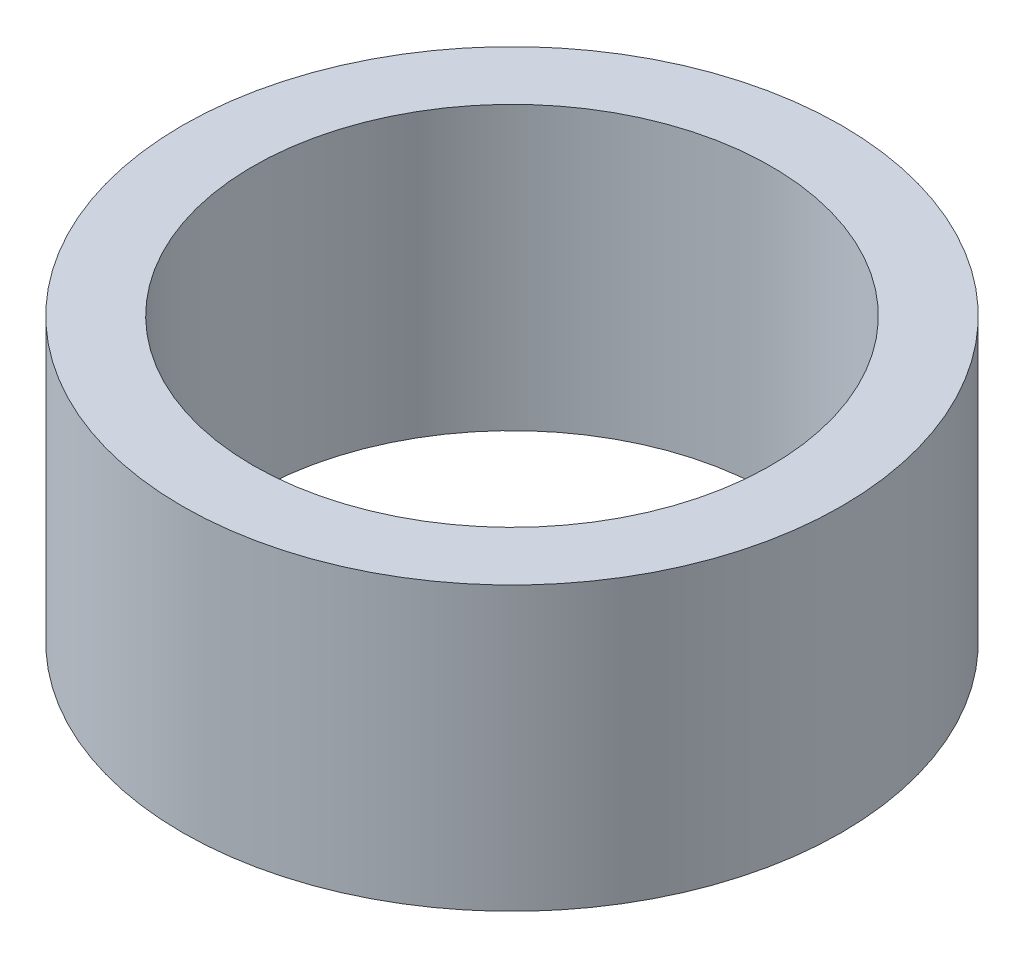
ISO-10303-21;
HEADER;
FILE_DESCRIPTION(('STEP AP214'),'2;1');
FILE_NAME('part.step','',(''),(''),'','','');
FILE_SCHEMA(('AUTOMOTIVE_DESIGN { 1 0 10303 214 1 1 1 1 }'));
ENDSEC;
DATA;
#1=APPLICATION_CONTEXT('core data for automotive mechanical design processes');
#2=APPLICATION_PROTOCOL_DEFINITION('international standard','automotive_design',2000,#1);
#3=PRODUCT_CONTEXT('',#1,'mechanical');
#4=PRODUCT('Part','Part','',(#3));
#5=PRODUCT_RELATED_PRODUCT_CATEGORY('part','',(#4));
#6=PRODUCT_DEFINITION_FORMATION('','',#4);
#7=PRODUCT_DEFINITION_CONTEXT('part definition',#1,'design');
#8=PRODUCT_DEFINITION('design','',#6,#7);
#9=PRODUCT_DEFINITION_SHAPE('','',#8);
#10=(LENGTH_UNIT() NAMED_UNIT(*) SI_UNIT(.MILLI.,.METRE.));
#11=(NAMED_UNIT(*) PLANE_ANGLE_UNIT() SI_UNIT($,.RADIAN.));
#12=(NAMED_UNIT(*) SI_UNIT($,.STERADIAN.) SOLID_ANGLE_UNIT());
#13=UNCERTAINTY_MEASURE_WITH_UNIT(LENGTH_MEASURE(1.E-05),#10,'distance_accuracy_value','');
#14=(GEOMETRIC_REPRESENTATION_CONTEXT(3) GLOBAL_UNCERTAINTY_ASSIGNED_CONTEXT((#13)) GLOBAL_UNIT_ASSIGNED_CONTEXT((#10,
#11,#12)) REPRESENTATION_CONTEXT('',''));
#15=CARTESIAN_POINT('',(0.,0.,0.));
#16=DIRECTION('',(0.,0.,1.));
#17=DIRECTION('',(1.,0.,0.));
#18=AXIS2_PLACEMENT_3D('',#15,#16,#17);
#19=CARTESIAN_POINT('',(0.,12.,0.));
#20=DIRECTION('',(0.,1.,0.));
#21=DIRECTION('',(0.,0.,1.));
#22=AXIS2_PLACEMENT_3D('',#19,#20,#21);
#23=PLANE('',#22);
#24=CARTESIAN_POINT('',(0.,12.,0.));
#25=DIRECTION('',(0.,1.,0.));
#26=DIRECTION('',(0.,0.,1.));
#27=AXIS2_PLACEMENT_3D('',#24,#25,#26);
#28=CIRCLE('',#27,14.);
#29=CARTESIAN_POINT('',(0.,12.,14.));
#30=VERTEX_POINT('',#29);
#31=EDGE_CURVE('E10',#30,#30,#28,.T.);
#32=ORIENTED_EDGE('',*,*,#31,.T.);
#33=EDGE_LOOP('',(#32));
#34=FACE_BOUND('',#33,.T.);
#35=CARTESIAN_POINT('',(0.,12.,0.));
#36=DIRECTION('',(0.,1.,0.));
#37=DIRECTION('',(0.,0.,1.));
#38=AXIS2_PLACEMENT_3D('',#35,#36,#37);
#39=CIRCLE('',#38,11.);
#40=CARTESIAN_POINT('',(0.,12.,11.));
#41=VERTEX_POINT('',#40);
#42=EDGE_CURVE('E48',#41,#41,#39,.T.);
#43=ORIENTED_EDGE('',*,*,#42,.F.);
#44=EDGE_LOOP('',(#43));
#45=FACE_BOUND('',#44,.T.);
#46=ADVANCED_FACE('F37',(#34,#45),#23,.T.);
#47=CARTESIAN_POINT('',(0.,0.,0.));
#48=DIRECTION('',(0.,1.,0.));
#49=DIRECTION('',(0.,0.,1.));
#50=AXIS2_PLACEMENT_3D('',#47,#48,#49);
#51=PLANE('',#50);
#52=CARTESIAN_POINT('',(0.,0.,0.));
#53=DIRECTION('',(0.,1.,0.));
#54=DIRECTION('',(0.,0.,1.));
#55=AXIS2_PLACEMENT_3D('',#52,#53,#54);
#56=CIRCLE('',#55,14.);
#57=CARTESIAN_POINT('',(0.,0.,14.));
#58=VERTEX_POINT('',#57);
#59=EDGE_CURVE('E41',#58,#58,#56,.T.);
#60=ORIENTED_EDGE('',*,*,#59,.F.);
#61=EDGE_LOOP('',(#60));
#62=FACE_BOUND('',#61,.T.);
#63=CARTESIAN_POINT('',(0.,0.,0.));
#64=DIRECTION('',(0.,1.,0.));
#65=DIRECTION('',(0.,0.,1.));
#66=AXIS2_PLACEMENT_3D('',#63,#64,#65);
#67=CIRCLE('',#66,11.);
#68=CARTESIAN_POINT('',(0.,0.,11.));
#69=VERTEX_POINT('',#68);
#70=EDGE_CURVE('E50',#69,#69,#67,.T.);
#71=ORIENTED_EDGE('',*,*,#70,.T.);
#72=EDGE_LOOP('',(#71));
#73=FACE_BOUND('',#72,.T.);
#74=ADVANCED_FACE('F60',(#62,#73),#51,.F.);
#75=CARTESIAN_POINT('',(0.,12.,0.));
#76=DIRECTION('',(0.,-1.,0.));
#77=DIRECTION('',(0.,0.,-1.));
#78=AXIS2_PLACEMENT_3D('',#75,#76,#77);
#79=CYLINDRICAL_SURFACE('',#78,14.);
#80=ORIENTED_EDGE('',*,*,#31,.F.);
#81=EDGE_LOOP('',(#80));
#82=FACE_BOUND('',#81,.T.);
#83=ORIENTED_EDGE('',*,*,#59,.T.);
#84=EDGE_LOOP('',(#83));
#85=FACE_BOUND('',#84,.T.);
#86=ADVANCED_FACE('F39',(#82,#85),#79,.T.);
#87=CARTESIAN_POINT('',(0.,12.,0.));
#88=DIRECTION('',(0.,-1.,0.));
#89=DIRECTION('',(0.,0.,-1.));
#90=AXIS2_PLACEMENT_3D('',#87,#88,#89);
#91=CYLINDRICAL_SURFACE('',#90,11.);
#92=ORIENTED_EDGE('',*,*,#42,.T.);
#93=EDGE_LOOP('',(#92));
#94=FACE_BOUND('',#93,.T.);
#95=ORIENTED_EDGE('',*,*,#70,.F.);
#96=EDGE_LOOP('',(#95));
#97=FACE_BOUND('',#96,.T.);
#98=ADVANCED_FACE('F56',(#94,#97),#91,.F.);
#99=CLOSED_SHELL('',(#46,#74,#86,#98));
#100=MANIFOLD_SOLID_BREP('B2',#99);
#101=ADVANCED_BREP_SHAPE_REPRESENTATION('',(#18,#100),#14);
#102=SHAPE_DEFINITION_REPRESENTATION(#9,#101);
ENDSEC;
END-ISO-10303-21;
